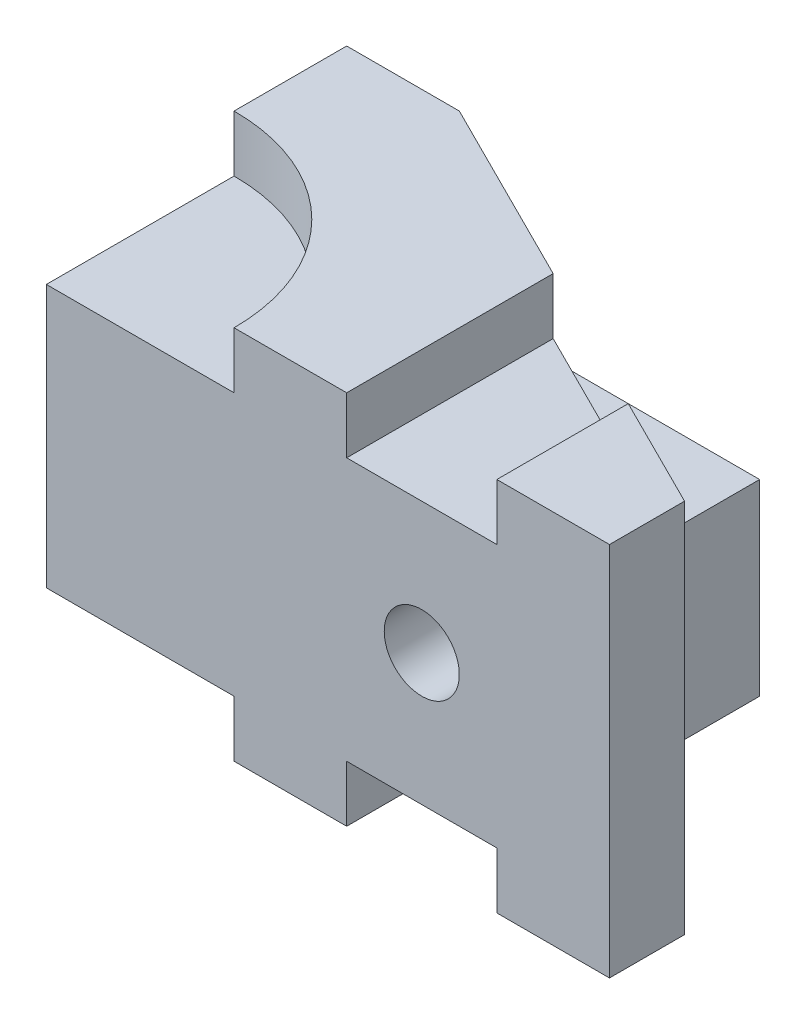
ISO-10303-21;
HEADER;
FILE_DESCRIPTION(('STEP AP214'),'2;1');
FILE_NAME('part.step','',(''),(''),'','','');
FILE_SCHEMA(('AUTOMOTIVE_DESIGN { 1 0 10303 214 1 1 1 1 }'));
ENDSEC;
DATA;
#1=APPLICATION_CONTEXT('core data for automotive mechanical design processes');
#2=APPLICATION_PROTOCOL_DEFINITION('international standard','automotive_design',2000,#1);
#3=PRODUCT_CONTEXT('',#1,'mechanical');
#4=PRODUCT('Part','Part','',(#3));
#5=PRODUCT_RELATED_PRODUCT_CATEGORY('part','',(#4));
#6=PRODUCT_DEFINITION_FORMATION('','',#4);
#7=PRODUCT_DEFINITION_CONTEXT('part definition',#1,'design');
#8=PRODUCT_DEFINITION('design','',#6,#7);
#9=PRODUCT_DEFINITION_SHAPE('','',#8);
#10=(LENGTH_UNIT() NAMED_UNIT(*) SI_UNIT(.MILLI.,.METRE.));
#11=(NAMED_UNIT(*) PLANE_ANGLE_UNIT() SI_UNIT($,.RADIAN.));
#12=(NAMED_UNIT(*) SI_UNIT($,.STERADIAN.) SOLID_ANGLE_UNIT());
#13=UNCERTAINTY_MEASURE_WITH_UNIT(LENGTH_MEASURE(1.E-05),#10,'distance_accuracy_value','');
#14=(GEOMETRIC_REPRESENTATION_CONTEXT(3) GLOBAL_UNCERTAINTY_ASSIGNED_CONTEXT((#13)) GLOBAL_UNIT_ASSIGNED_CONTEXT((#10,
#11,#12)) REPRESENTATION_CONTEXT('',''));
#15=CARTESIAN_POINT('',(0.,0.,0.));
#16=DIRECTION('',(0.,0.,1.));
#17=DIRECTION('',(1.,0.,0.));
#18=AXIS2_PLACEMENT_3D('',#15,#16,#17);
#19=CARTESIAN_POINT('',(-75.,100.,0.));
#20=DIRECTION('',(-1.,0.,0.));
#21=DIRECTION('',(0.,0.,1.));
#22=AXIS2_PLACEMENT_3D('',#19,#20,#21);
#23=PLANE('',#22);
#24=DIRECTION('',(0.,1.,0.));
#25=VECTOR('',#24,1.);
#26=CARTESIAN_POINT('',(-75.,65.,-20.));
#27=LINE('',#26,#25);
#28=CARTESIAN_POINT('',(-75.,35.,-20.));
#29=VERTEX_POINT('',#28);
#30=CARTESIAN_POINT('',(-75.,65.,-20.));
#31=VERTEX_POINT('',#30);
#32=EDGE_CURVE('E221',#29,#31,#27,.T.);
#33=ORIENTED_EDGE('',*,*,#32,.F.);
#34=DIRECTION('',(0.,0.,1.));
#35=VECTOR('',#34,1.);
#36=CARTESIAN_POINT('',(-75.,35.,-40.));
#37=LINE('',#36,#35);
#38=CARTESIAN_POINT('',(-75.,35.,-40.));
#39=VERTEX_POINT('',#38);
#40=EDGE_CURVE('E210',#39,#29,#37,.T.);
#41=ORIENTED_EDGE('',*,*,#40,.F.);
#42=DIRECTION('',(0.,-1.,0.));
#43=VECTOR('',#42,1.);
#44=CARTESIAN_POINT('',(-75.,100.,-40.));
#45=LINE('',#44,#43);
#46=CARTESIAN_POINT('',(-75.,0.,-40.));
#47=VERTEX_POINT('',#46);
#48=EDGE_CURVE('E219',#39,#47,#45,.T.);
#49=ORIENTED_EDGE('',*,*,#48,.T.);
#50=DIRECTION('',(0.,0.,-1.));
#51=VECTOR('',#50,1.);
#52=CARTESIAN_POINT('',(-75.,0.,0.));
#53=LINE('',#52,#51);
#54=CARTESIAN_POINT('',(-75.,0.,-10.));
#55=VERTEX_POINT('',#54);
#56=EDGE_CURVE('E377',#55,#47,#53,.T.);
#57=ORIENTED_EDGE('',*,*,#56,.F.);
#58=DIRECTION('',(0.,-1.,0.));
#59=VECTOR('',#58,1.);
#60=CARTESIAN_POINT('',(-75.,15.,-10.));
#61=LINE('',#60,#59);
#62=CARTESIAN_POINT('',(-75.,15.,-10.));
#63=VERTEX_POINT('',#62);
#64=EDGE_CURVE('E69',#55,#63,#61,.F.);
#65=ORIENTED_EDGE('',*,*,#64,.T.);
#66=DIRECTION('',(0.,0.,1.));
#67=VECTOR('',#66,1.);
#68=CARTESIAN_POINT('',(-75.,15.,0.));
#69=LINE('',#68,#67);
#70=CARTESIAN_POINT('',(-75.,15.,40.));
#71=VERTEX_POINT('',#70);
#72=EDGE_CURVE('E267',#63,#71,#69,.T.);
#73=ORIENTED_EDGE('',*,*,#72,.T.);
#74=DIRECTION('',(0.,-1.,0.));
#75=VECTOR('',#74,1.);
#76=CARTESIAN_POINT('',(-75.,100.,40.));
#77=LINE('',#76,#75);
#78=CARTESIAN_POINT('',(-75.,85.,40.));
#79=VERTEX_POINT('',#78);
#80=EDGE_CURVE('E231',#79,#71,#77,.T.);
#81=ORIENTED_EDGE('',*,*,#80,.F.);
#82=DIRECTION('',(0.,0.,-1.));
#83=VECTOR('',#82,1.);
#84=CARTESIAN_POINT('',(-75.,85.,0.));
#85=LINE('',#84,#83);
#86=CARTESIAN_POINT('',(-75.,85.,-10.));
#87=VERTEX_POINT('',#86);
#88=EDGE_CURVE('E286',#79,#87,#85,.T.);
#89=ORIENTED_EDGE('',*,*,#88,.T.);
#90=DIRECTION('',(0.,1.,0.));
#91=VECTOR('',#90,1.);
#92=CARTESIAN_POINT('',(-75.,85.,-10.));
#93=LINE('',#92,#91);
#94=CARTESIAN_POINT('',(-75.,100.,-10.));
#95=VERTEX_POINT('',#94);
#96=EDGE_CURVE('E291',#95,#87,#93,.F.);
#97=ORIENTED_EDGE('',*,*,#96,.F.);
#98=DIRECTION('',(0.,0.,-1.));
#99=VECTOR('',#98,1.);
#100=CARTESIAN_POINT('',(-75.,100.,0.));
#101=LINE('',#100,#99);
#102=CARTESIAN_POINT('',(-75.,100.,-40.));
#103=VERTEX_POINT('',#102);
#104=EDGE_CURVE('E358',#95,#103,#101,.T.);
#105=ORIENTED_EDGE('',*,*,#104,.T.);
#106=CARTESIAN_POINT('',(-75.,65.,-40.));
#107=VERTEX_POINT('',#106);
#108=EDGE_CURVE('E230',#103,#107,#45,.T.);
#109=ORIENTED_EDGE('',*,*,#108,.T.);
#110=DIRECTION('',(0.,0.,1.));
#111=VECTOR('',#110,1.);
#112=CARTESIAN_POINT('',(-75.,65.,-40.));
#113=LINE('',#112,#111);
#114=EDGE_CURVE('E61',#107,#31,#113,.T.);
#115=ORIENTED_EDGE('',*,*,#114,.T.);
#116=EDGE_LOOP('',(#33,#41,#49,#57,#65,#73,#81,#89,#97,#105,#109,#115));
#117=FACE_BOUND('',#116,.T.);
#118=ADVANCED_FACE('F45',(#117),#23,.T.);
#119=CARTESIAN_POINT('',(7.,100.,-14.));
#120=DIRECTION('',(0.447213595499958,0.,-0.894427190999916));
#121=DIRECTION('',(-0.894427190999916,0.,-0.447213595499958));
#122=AXIS2_PLACEMENT_3D('',#119,#120,#121);
#123=PLANE('',#122);
#124=DIRECTION('',(0.,-1.,0.));
#125=VECTOR('',#124,1.);
#126=CARTESIAN_POINT('',(-45.,100.,-40.));
#127=LINE('',#126,#125);
#128=CARTESIAN_POINT('',(-45.,35.,-40.));
#129=VERTEX_POINT('',#128);
#130=CARTESIAN_POINT('',(-45.,0.,-40.));
#131=VERTEX_POINT('',#130);
#132=EDGE_CURVE('E236',#129,#131,#127,.T.);
#133=ORIENTED_EDGE('',*,*,#132,.F.);
#134=DIRECTION('',(0.894427190999916,0.,0.447213595499958));
#135=VECTOR('',#134,1.);
#136=CARTESIAN_POINT('',(7.,35.,-14.));
#137=LINE('',#136,#135);
#138=CARTESIAN_POINT('',(-4.99999999999998,35.,-20.));
#139=VERTEX_POINT('',#138);
#140=EDGE_CURVE('E213',#129,#139,#137,.T.);
#141=ORIENTED_EDGE('',*,*,#140,.T.);
#142=DIRECTION('',(0.,-1.,0.));
#143=VECTOR('',#142,1.);
#144=CARTESIAN_POINT('',(-4.99999999999998,100.,-20.));
#145=LINE('',#144,#143);
#146=CARTESIAN_POINT('',(-4.99999999999998,25.,-20.));
#147=VERTEX_POINT('',#146);
#148=EDGE_CURVE('E246',#139,#147,#145,.T.);
#149=ORIENTED_EDGE('',*,*,#148,.T.);
#150=DIRECTION('',(0.894427190999916,0.,0.447213595499958));
#151=VECTOR('',#150,1.);
#152=CARTESIAN_POINT('',(-4.99999999999998,25.,-20.));
#153=LINE('',#152,#151);
#154=CARTESIAN_POINT('',(55.,25.,10.));
#155=VERTEX_POINT('',#154);
#156=EDGE_CURVE('E456',#147,#155,#153,.T.);
#157=ORIENTED_EDGE('',*,*,#156,.T.);
#158=DIRECTION('',(0.,-1.,0.));
#159=VECTOR('',#158,1.);
#160=CARTESIAN_POINT('',(55.,100.,10.));
#161=LINE('',#160,#159);
#162=CARTESIAN_POINT('',(55.,75.,10.));
#163=VERTEX_POINT('',#162);
#164=EDGE_CURVE('E255',#163,#155,#161,.T.);
#165=ORIENTED_EDGE('',*,*,#164,.F.);
#166=DIRECTION('',(0.894427190999916,0.,0.447213595499958));
#167=VECTOR('',#166,1.);
#168=CARTESIAN_POINT('',(-4.99999999999998,75.,-20.));
#169=LINE('',#168,#167);
#170=CARTESIAN_POINT('',(-4.99999999999998,75.,-20.));
#171=VERTEX_POINT('',#170);
#172=EDGE_CURVE('E435',#171,#163,#169,.T.);
#173=ORIENTED_EDGE('',*,*,#172,.F.);
#174=CARTESIAN_POINT('',(-4.99999999999998,65.,-20.));
#175=VERTEX_POINT('',#174);
#176=EDGE_CURVE('E247',#171,#175,#145,.T.);
#177=ORIENTED_EDGE('',*,*,#176,.T.);
#178=DIRECTION('',(-0.894427190999916,0.,-0.447213595499958));
#179=VECTOR('',#178,1.);
#180=CARTESIAN_POINT('',(7.,65.,-14.));
#181=LINE('',#180,#179);
#182=CARTESIAN_POINT('',(-45.,65.,-40.));
#183=VERTEX_POINT('',#182);
#184=EDGE_CURVE('E223',#175,#183,#181,.T.);
#185=ORIENTED_EDGE('',*,*,#184,.T.);
#186=CARTESIAN_POINT('',(-45.,100.,-40.));
#187=VERTEX_POINT('',#186);
#188=EDGE_CURVE('E242',#187,#183,#127,.T.);
#189=ORIENTED_EDGE('',*,*,#188,.F.);
#190=DIRECTION('',(0.894427190999916,0.,0.447213595499958));
#191=VECTOR('',#190,1.);
#192=CARTESIAN_POINT('',(7.,100.,-14.));
#193=LINE('',#192,#191);
#194=CARTESIAN_POINT('',(5.,100.,-15.));
#195=VERTEX_POINT('',#194);
#196=EDGE_CURVE('E350',#187,#195,#193,.T.);
#197=ORIENTED_EDGE('',*,*,#196,.T.);
#198=DIRECTION('',(0.,1.,0.));
#199=VECTOR('',#198,1.);
#200=CARTESIAN_POINT('',(5.,85.,-15.));
#201=LINE('',#200,#199);
#202=CARTESIAN_POINT('',(5.,85.,-15.));
#203=VERTEX_POINT('',#202);
#204=EDGE_CURVE('E312',#203,#195,#201,.T.);
#205=ORIENTED_EDGE('',*,*,#204,.F.);
#206=DIRECTION('',(-0.894427190999916,0.,-0.447213595499958));
#207=VECTOR('',#206,1.);
#208=CARTESIAN_POINT('',(5.,85.,-15.));
#209=LINE('',#208,#207);
#210=CARTESIAN_POINT('',(45.,85.,4.99999999999999));
#211=VERTEX_POINT('',#210);
#212=EDGE_CURVE('E330',#211,#203,#209,.T.);
#213=ORIENTED_EDGE('',*,*,#212,.F.);
#214=DIRECTION('',(0.,1.,0.));
#215=VECTOR('',#214,1.);
#216=CARTESIAN_POINT('',(45.,85.,4.99999999999999));
#217=LINE('',#216,#215);
#218=CARTESIAN_POINT('',(45.,100.,4.99999999999999));
#219=VERTEX_POINT('',#218);
#220=EDGE_CURVE('E308',#211,#219,#217,.T.);
#221=ORIENTED_EDGE('',*,*,#220,.T.);
#222=DIRECTION('',(0.894427190999916,0.,0.447213595499958));
#223=VECTOR('',#222,1.);
#224=CARTESIAN_POINT('',(7.,100.,-14.));
#225=LINE('',#224,#223);
#226=CARTESIAN_POINT('',(75.,100.,20.));
#227=VERTEX_POINT('',#226);
#228=EDGE_CURVE('E346',#219,#227,#225,.T.);
#229=ORIENTED_EDGE('',*,*,#228,.T.);
#230=DIRECTION('',(0.,-1.,0.));
#231=VECTOR('',#230,1.);
#232=CARTESIAN_POINT('',(75.,100.,20.));
#233=LINE('',#232,#231);
#234=CARTESIAN_POINT('',(75.,0.,20.));
#235=VERTEX_POINT('',#234);
#236=EDGE_CURVE('E368',#227,#235,#233,.T.);
#237=ORIENTED_EDGE('',*,*,#236,.T.);
#238=DIRECTION('',(0.894427190999916,0.,0.447213595499958));
#239=VECTOR('',#238,1.);
#240=CARTESIAN_POINT('',(7.,0.,-14.));
#241=LINE('',#240,#239);
#242=CARTESIAN_POINT('',(45.,0.,4.99999999999999));
#243=VERTEX_POINT('',#242);
#244=EDGE_CURVE('E345',#243,#235,#241,.T.);
#245=ORIENTED_EDGE('',*,*,#244,.F.);
#246=DIRECTION('',(0.,-1.,0.));
#247=VECTOR('',#246,1.);
#248=CARTESIAN_POINT('',(45.,15.,4.99999999999999));
#249=LINE('',#248,#247);
#250=CARTESIAN_POINT('',(45.,15.,4.99999999999999));
#251=VERTEX_POINT('',#250);
#252=EDGE_CURVE('E405',#251,#243,#249,.T.);
#253=ORIENTED_EDGE('',*,*,#252,.F.);
#254=DIRECTION('',(-0.894427190999916,0.,-0.447213595499958));
#255=VECTOR('',#254,1.);
#256=CARTESIAN_POINT('',(5.,15.,-15.));
#257=LINE('',#256,#255);
#258=CARTESIAN_POINT('',(5.,15.,-15.));
#259=VERTEX_POINT('',#258);
#260=EDGE_CURVE('E477',#251,#259,#257,.T.);
#261=ORIENTED_EDGE('',*,*,#260,.T.);
#262=DIRECTION('',(0.,-1.,0.));
#263=VECTOR('',#262,1.);
#264=CARTESIAN_POINT('',(5.,15.,-15.));
#265=LINE('',#264,#263);
#266=CARTESIAN_POINT('',(5.,0.,-15.));
#267=VERTEX_POINT('',#266);
#268=EDGE_CURVE('E415',#259,#267,#265,.T.);
#269=ORIENTED_EDGE('',*,*,#268,.T.);
#270=DIRECTION('',(0.894427190999916,0.,0.447213595499958));
#271=VECTOR('',#270,1.);
#272=CARTESIAN_POINT('',(7.,0.,-14.));
#273=LINE('',#272,#271);
#274=EDGE_CURVE('E372',#131,#267,#273,.T.);
#275=ORIENTED_EDGE('',*,*,#274,.F.);
#276=EDGE_LOOP('',(#133,#141,#149,#157,#165,#173,#177,#185,#189,#197,#205,#213,#221,#229,#237,
#245,#253,#261,#269,#275));
#277=FACE_BOUND('',#276,.T.);
#278=ADVANCED_FACE('F404',(#277),#123,.T.);
#279=CARTESIAN_POINT('',(0.,100.,-40.));
#280=DIRECTION('',(0.,0.,-1.));
#281=DIRECTION('',(-1.,0.,0.));
#282=AXIS2_PLACEMENT_3D('',#279,#280,#281);
#283=PLANE('',#282);
#284=ORIENTED_EDGE('',*,*,#48,.F.);
#285=DIRECTION('',(1.,0.,0.));
#286=VECTOR('',#285,1.);
#287=CARTESIAN_POINT('',(0.,35.,-40.));
#288=LINE('',#287,#286);
#289=EDGE_CURVE('E11',#39,#129,#288,.T.);
#290=ORIENTED_EDGE('',*,*,#289,.T.);
#291=ORIENTED_EDGE('',*,*,#132,.T.);
#292=DIRECTION('',(1.,0.,0.));
#293=VECTOR('',#292,1.);
#294=CARTESIAN_POINT('',(0.,0.,-40.));
#295=LINE('',#294,#293);
#296=EDGE_CURVE('E228',#47,#131,#295,.T.);
#297=ORIENTED_EDGE('',*,*,#296,.F.);
#298=EDGE_LOOP('',(#284,#290,#291,#297));
#299=FACE_BOUND('',#298,.T.);
#300=ADVANCED_FACE('F226',(#299),#283,.T.);
#301=ORIENTED_EDGE('',*,*,#188,.T.);
#302=DIRECTION('',(1.,0.,0.));
#303=VECTOR('',#302,1.);
#304=CARTESIAN_POINT('',(-4.99999999999998,65.,-40.));
#305=LINE('',#304,#303);
#306=EDGE_CURVE('E553',#107,#183,#305,.T.);
#307=ORIENTED_EDGE('',*,*,#306,.F.);
#308=ORIENTED_EDGE('',*,*,#108,.F.);
#309=DIRECTION('',(1.,0.,0.));
#310=VECTOR('',#309,1.);
#311=CARTESIAN_POINT('',(0.,100.,-40.));
#312=LINE('',#311,#310);
#313=EDGE_CURVE('E354',#103,#187,#312,.T.);
#314=ORIENTED_EDGE('',*,*,#313,.T.);
#315=EDGE_LOOP('',(#301,#307,#308,#314));
#316=FACE_BOUND('',#315,.T.);
#317=ADVANCED_FACE('F535',(#316),#283,.T.);
#318=CARTESIAN_POINT('',(0.,0.,0.));
#319=DIRECTION('',(0.,1.,0.));
#320=DIRECTION('',(0.,0.,1.));
#321=AXIS2_PLACEMENT_3D('',#318,#319,#320);
#322=PLANE('',#321);
#323=DIRECTION('',(0.,0.,-1.));
#324=VECTOR('',#323,1.);
#325=CARTESIAN_POINT('',(45.,0.,4.99999999999999));
#326=LINE('',#325,#324);
#327=CARTESIAN_POINT('',(45.,0.,40.));
#328=VERTEX_POINT('',#327);
#329=EDGE_CURVE('E401',#328,#243,#326,.T.);
#330=ORIENTED_EDGE('',*,*,#329,.T.);
#331=ORIENTED_EDGE('',*,*,#244,.T.);
#332=DIRECTION('',(0.,0.,-1.));
#333=VECTOR('',#332,1.);
#334=CARTESIAN_POINT('',(75.,0.,0.));
#335=LINE('',#334,#333);
#336=CARTESIAN_POINT('',(75.,0.,40.));
#337=VERTEX_POINT('',#336);
#338=EDGE_CURVE('E351',#337,#235,#335,.T.);
#339=ORIENTED_EDGE('',*,*,#338,.F.);
#340=DIRECTION('',(1.,0.,0.));
#341=VECTOR('',#340,1.);
#342=CARTESIAN_POINT('',(0.,0.,40.));
#343=LINE('',#342,#341);
#344=EDGE_CURVE('E380',#328,#337,#343,.T.);
#345=ORIENTED_EDGE('',*,*,#344,.F.);
#346=EDGE_LOOP('',(#330,#331,#339,#345));
#347=FACE_BOUND('',#346,.T.);
#348=ADVANCED_FACE('F400',(#347),#322,.F.);
#349=ORIENTED_EDGE('',*,*,#274,.T.);
#350=DIRECTION('',(0.,0.,1.));
#351=VECTOR('',#350,1.);
#352=CARTESIAN_POINT('',(5.,0.,40.));
#353=LINE('',#352,#351);
#354=CARTESIAN_POINT('',(5.,0.,40.));
#355=VERTEX_POINT('',#354);
#356=EDGE_CURVE('E461',#267,#355,#353,.T.);
#357=ORIENTED_EDGE('',*,*,#356,.T.);
#358=CARTESIAN_POINT('',(-25.,0.,40.));
#359=VERTEX_POINT('',#358);
#360=EDGE_CURVE('E383',#359,#355,#343,.T.);
#361=ORIENTED_EDGE('',*,*,#360,.F.);
#362=CARTESIAN_POINT('',(-75.,0.,40.));
#363=DIRECTION('',(0.,1.,0.));
#364=DIRECTION('',(0.,0.,1.));
#365=AXIS2_PLACEMENT_3D('',#362,#363,#364);
#366=CIRCLE('',#365,50.);
#367=EDGE_CURVE('E419',#359,#55,#366,.T.);
#368=ORIENTED_EDGE('',*,*,#367,.T.);
#369=ORIENTED_EDGE('',*,*,#56,.T.);
#370=ORIENTED_EDGE('',*,*,#296,.T.);
#371=EDGE_LOOP('',(#349,#357,#361,#368,#369,#370));
#372=FACE_BOUND('',#371,.T.);
#373=ADVANCED_FACE('F489',(#372),#322,.F.);
#374=CARTESIAN_POINT('',(0.,100.,40.));
#375=DIRECTION('',(0.,0.,-1.));
#376=DIRECTION('',(-1.,0.,0.));
#377=AXIS2_PLACEMENT_3D('',#374,#375,#376);
#378=PLANE('',#377);
#379=CARTESIAN_POINT('',(25.,50.,40.));
#380=DIRECTION('',(0.,0.,-1.));
#381=DIRECTION('',(-1.,0.,0.));
#382=AXIS2_PLACEMENT_3D('',#379,#380,#381);
#383=CIRCLE('',#382,10.);
#384=CARTESIAN_POINT('',(15.,50.,40.));
#385=VERTEX_POINT('',#384);
#386=EDGE_CURVE('E546',#385,#385,#383,.T.);
#387=ORIENTED_EDGE('',*,*,#386,.T.);
#388=EDGE_LOOP('',(#387));
#389=FACE_BOUND('',#388,.T.);
#390=DIRECTION('',(0.,-1.,0.));
#391=VECTOR('',#390,1.);
#392=CARTESIAN_POINT('',(-25.,15.,40.));
#393=LINE('',#392,#391);
#394=CARTESIAN_POINT('',(-25.,15.,40.));
#395=VERTEX_POINT('',#394);
#396=EDGE_CURVE('E428',#359,#395,#393,.F.);
#397=ORIENTED_EDGE('',*,*,#396,.F.);
#398=ORIENTED_EDGE('',*,*,#360,.T.);
#399=DIRECTION('',(0.,-1.,0.));
#400=VECTOR('',#399,1.);
#401=CARTESIAN_POINT('',(5.,15.,40.));
#402=LINE('',#401,#400);
#403=CARTESIAN_POINT('',(5.,15.,40.));
#404=VERTEX_POINT('',#403);
#405=EDGE_CURVE('E422',#404,#355,#402,.T.);
#406=ORIENTED_EDGE('',*,*,#405,.F.);
#407=DIRECTION('',(1.,0.,0.));
#408=VECTOR('',#407,1.);
#409=CARTESIAN_POINT('',(45.,15.,40.));
#410=LINE('',#409,#408);
#411=CARTESIAN_POINT('',(45.,15.,40.));
#412=VERTEX_POINT('',#411);
#413=EDGE_CURVE('E470',#404,#412,#410,.T.);
#414=ORIENTED_EDGE('',*,*,#413,.T.);
#415=DIRECTION('',(0.,-1.,0.));
#416=VECTOR('',#415,1.);
#417=CARTESIAN_POINT('',(45.,15.,40.));
#418=LINE('',#417,#416);
#419=EDGE_CURVE('E414',#412,#328,#418,.T.);
#420=ORIENTED_EDGE('',*,*,#419,.T.);
#421=ORIENTED_EDGE('',*,*,#344,.T.);
#422=DIRECTION('',(0.,-1.,0.));
#423=VECTOR('',#422,1.);
#424=CARTESIAN_POINT('',(75.,100.,40.));
#425=LINE('',#424,#423);
#426=CARTESIAN_POINT('',(75.,100.,40.));
#427=VERTEX_POINT('',#426);
#428=EDGE_CURVE('E238',#427,#337,#425,.T.);
#429=ORIENTED_EDGE('',*,*,#428,.F.);
#430=DIRECTION('',(1.,0.,0.));
#431=VECTOR('',#430,1.);
#432=CARTESIAN_POINT('',(0.,100.,40.));
#433=LINE('',#432,#431);
#434=CARTESIAN_POINT('',(45.,100.,40.));
#435=VERTEX_POINT('',#434);
#436=EDGE_CURVE('E361',#435,#427,#433,.T.);
#437=ORIENTED_EDGE('',*,*,#436,.F.);
#438=DIRECTION('',(0.,1.,0.));
#439=VECTOR('',#438,1.);
#440=CARTESIAN_POINT('',(45.,85.,40.));
#441=LINE('',#440,#439);
#442=CARTESIAN_POINT('',(45.,85.,40.));
#443=VERTEX_POINT('',#442);
#444=EDGE_CURVE('E304',#443,#435,#441,.T.);
#445=ORIENTED_EDGE('',*,*,#444,.F.);
#446=DIRECTION('',(1.,0.,0.));
#447=VECTOR('',#446,1.);
#448=CARTESIAN_POINT('',(45.,85.,40.));
#449=LINE('',#448,#447);
#450=CARTESIAN_POINT('',(5.,85.,40.));
#451=VERTEX_POINT('',#450);
#452=EDGE_CURVE('E323',#451,#443,#449,.T.);
#453=ORIENTED_EDGE('',*,*,#452,.F.);
#454=DIRECTION('',(0.,1.,0.));
#455=VECTOR('',#454,1.);
#456=CARTESIAN_POINT('',(5.,85.,40.));
#457=LINE('',#456,#455);
#458=CARTESIAN_POINT('',(5.,100.,40.));
#459=VERTEX_POINT('',#458);
#460=EDGE_CURVE('E316',#451,#459,#457,.T.);
#461=ORIENTED_EDGE('',*,*,#460,.T.);
#462=CARTESIAN_POINT('',(-25.,100.,40.));
#463=VERTEX_POINT('',#462);
#464=EDGE_CURVE('E364',#463,#459,#433,.T.);
#465=ORIENTED_EDGE('',*,*,#464,.F.);
#466=DIRECTION('',(0.,1.,0.));
#467=VECTOR('',#466,1.);
#468=CARTESIAN_POINT('',(-25.,85.,40.));
#469=LINE('',#468,#467);
#470=CARTESIAN_POINT('',(-25.,85.,40.));
#471=VERTEX_POINT('',#470);
#472=EDGE_CURVE('E280',#463,#471,#469,.F.);
#473=ORIENTED_EDGE('',*,*,#472,.T.);
#474=DIRECTION('',(1.,0.,0.));
#475=VECTOR('',#474,1.);
#476=CARTESIAN_POINT('',(0.,85.,40.));
#477=LINE('',#476,#475);
#478=EDGE_CURVE('E259',#79,#471,#477,.T.);
#479=ORIENTED_EDGE('',*,*,#478,.F.);
#480=ORIENTED_EDGE('',*,*,#80,.T.);
#481=DIRECTION('',(-1.,0.,0.));
#482=VECTOR('',#481,1.);
#483=CARTESIAN_POINT('',(0.,15.,40.));
#484=LINE('',#483,#482);
#485=EDGE_CURVE('E54',#395,#71,#484,.T.);
#486=ORIENTED_EDGE('',*,*,#485,.F.);
#487=EDGE_LOOP('',(#397,#398,#406,#414,#420,#421,#429,#437,#445,#453,#461,#465,#473,#479,#480,#486));
#488=FACE_BOUND('',#487,.T.);
#489=ADVANCED_FACE('F277',(#389,#488),#378,.F.);
#490=CARTESIAN_POINT('',(0.,100.,0.));
#491=DIRECTION('',(0.,1.,0.));
#492=DIRECTION('',(0.,0.,1.));
#493=AXIS2_PLACEMENT_3D('',#490,#491,#492);
#494=PLANE('',#493);
#495=DIRECTION('',(0.,0.,1.));
#496=VECTOR('',#495,1.);
#497=CARTESIAN_POINT('',(5.,100.,40.));
#498=LINE('',#497,#496);
#499=EDGE_CURVE('E320',#195,#459,#498,.T.);
#500=ORIENTED_EDGE('',*,*,#499,.F.);
#501=ORIENTED_EDGE('',*,*,#196,.F.);
#502=ORIENTED_EDGE('',*,*,#313,.F.);
#503=ORIENTED_EDGE('',*,*,#104,.F.);
#504=CARTESIAN_POINT('',(-75.,100.,40.));
#505=DIRECTION('',(0.,1.,0.));
#506=DIRECTION('',(0.,0.,1.));
#507=AXIS2_PLACEMENT_3D('',#504,#505,#506);
#508=CIRCLE('',#507,50.);
#509=EDGE_CURVE('E293',#463,#95,#508,.T.);
#510=ORIENTED_EDGE('',*,*,#509,.F.);
#511=ORIENTED_EDGE('',*,*,#464,.T.);
#512=EDGE_LOOP('',(#500,#501,#502,#503,#510,#511));
#513=FACE_BOUND('',#512,.T.);
#514=ADVANCED_FACE('F499',(#513),#494,.T.);
#515=CARTESIAN_POINT('',(55.,100.,0.));
#516=DIRECTION('',(1.,0.,0.));
#517=DIRECTION('',(0.,0.,-1.));
#518=AXIS2_PLACEMENT_3D('',#515,#516,#517);
#519=PLANE('',#518);
#520=DIRECTION('',(0.,0.,-1.));
#521=VECTOR('',#520,1.);
#522=CARTESIAN_POINT('',(55.,25.,10.));
#523=LINE('',#522,#521);
#524=CARTESIAN_POINT('',(55.,25.,-20.));
#525=VERTEX_POINT('',#524);
#526=EDGE_CURVE('E452',#155,#525,#523,.T.);
#527=ORIENTED_EDGE('',*,*,#526,.T.);
#528=DIRECTION('',(0.,-1.,0.));
#529=VECTOR('',#528,1.);
#530=CARTESIAN_POINT('',(55.,100.,-20.));
#531=LINE('',#530,#529);
#532=CARTESIAN_POINT('',(55.,75.,-20.));
#533=VERTEX_POINT('',#532);
#534=EDGE_CURVE('E251',#533,#525,#531,.T.);
#535=ORIENTED_EDGE('',*,*,#534,.F.);
#536=DIRECTION('',(0.,0.,-1.));
#537=VECTOR('',#536,1.);
#538=CARTESIAN_POINT('',(55.,75.,10.));
#539=LINE('',#538,#537);
#540=EDGE_CURVE('E301',#163,#533,#539,.T.);
#541=ORIENTED_EDGE('',*,*,#540,.F.);
#542=ORIENTED_EDGE('',*,*,#164,.T.);
#543=EDGE_LOOP('',(#527,#535,#541,#542));
#544=FACE_BOUND('',#543,.T.);
#545=ADVANCED_FACE('F47',(#544),#519,.T.);
#546=CARTESIAN_POINT('',(0.,100.,-20.));
#547=DIRECTION('',(0.,0.,-1.));
#548=DIRECTION('',(-1.,0.,0.));
#549=AXIS2_PLACEMENT_3D('',#546,#547,#548);
#550=PLANE('',#549);
#551=CARTESIAN_POINT('',(25.,50.,-20.));
#552=DIRECTION('',(0.,0.,-1.));
#553=DIRECTION('',(-1.,0.,0.));
#554=AXIS2_PLACEMENT_3D('',#551,#552,#553);
#555=CIRCLE('',#554,10.);
#556=CARTESIAN_POINT('',(15.,50.,-20.));
#557=VERTEX_POINT('',#556);
#558=EDGE_CURVE('E543',#557,#557,#555,.T.);
#559=ORIENTED_EDGE('',*,*,#558,.F.);
#560=EDGE_LOOP('',(#559));
#561=FACE_BOUND('',#560,.T.);
#562=DIRECTION('',(-1.,0.,0.));
#563=VECTOR('',#562,1.);
#564=CARTESIAN_POINT('',(55.,25.,-20.));
#565=LINE('',#564,#563);
#566=EDGE_CURVE('E457',#525,#147,#565,.T.);
#567=ORIENTED_EDGE('',*,*,#566,.T.);
#568=ORIENTED_EDGE('',*,*,#148,.F.);
#569=DIRECTION('',(-1.,0.,0.));
#570=VECTOR('',#569,1.);
#571=CARTESIAN_POINT('',(-4.99999999999998,35.,-20.));
#572=LINE('',#571,#570);
#573=EDGE_CURVE('E550',#139,#29,#572,.T.);
#574=ORIENTED_EDGE('',*,*,#573,.T.);
#575=ORIENTED_EDGE('',*,*,#32,.T.);
#576=DIRECTION('',(1.,0.,0.));
#577=VECTOR('',#576,1.);
#578=CARTESIAN_POINT('',(-4.99999999999998,65.,-20.));
#579=LINE('',#578,#577);
#580=EDGE_CURVE('E556',#31,#175,#579,.T.);
#581=ORIENTED_EDGE('',*,*,#580,.T.);
#582=ORIENTED_EDGE('',*,*,#176,.F.);
#583=DIRECTION('',(-1.,0.,0.));
#584=VECTOR('',#583,1.);
#585=CARTESIAN_POINT('',(55.,75.,-20.));
#586=LINE('',#585,#584);
#587=EDGE_CURVE('E274',#533,#171,#586,.T.);
#588=ORIENTED_EDGE('',*,*,#587,.F.);
#589=ORIENTED_EDGE('',*,*,#534,.T.);
#590=EDGE_LOOP('',(#567,#568,#574,#575,#581,#582,#588,#589));
#591=FACE_BOUND('',#590,.T.);
#592=ADVANCED_FACE('F448',(#561,#591),#550,.T.);
#593=CARTESIAN_POINT('',(75.,100.,0.));
#594=DIRECTION('',(-1.,0.,0.));
#595=DIRECTION('',(0.,0.,1.));
#596=AXIS2_PLACEMENT_3D('',#593,#594,#595);
#597=PLANE('',#596);
#598=ORIENTED_EDGE('',*,*,#338,.T.);
#599=ORIENTED_EDGE('',*,*,#236,.F.);
#600=DIRECTION('',(0.,0.,-1.));
#601=VECTOR('',#600,1.);
#602=CARTESIAN_POINT('',(75.,100.,0.));
#603=LINE('',#602,#601);
#604=EDGE_CURVE('E365',#427,#227,#603,.T.);
#605=ORIENTED_EDGE('',*,*,#604,.F.);
#606=ORIENTED_EDGE('',*,*,#428,.T.);
#607=EDGE_LOOP('',(#598,#599,#605,#606));
#608=FACE_BOUND('',#607,.T.);
#609=ADVANCED_FACE('F394',(#608),#597,.F.);
#610=ORIENTED_EDGE('',*,*,#228,.F.);
#611=DIRECTION('',(0.,0.,-1.));
#612=VECTOR('',#611,1.);
#613=CARTESIAN_POINT('',(45.,100.,4.99999999999999));
#614=LINE('',#613,#612);
#615=EDGE_CURVE('E298',#435,#219,#614,.T.);
#616=ORIENTED_EDGE('',*,*,#615,.F.);
#617=ORIENTED_EDGE('',*,*,#436,.T.);
#618=ORIENTED_EDGE('',*,*,#604,.T.);
#619=EDGE_LOOP('',(#610,#616,#617,#618));
#620=FACE_BOUND('',#619,.T.);
#621=ADVANCED_FACE('F514',(#620),#494,.T.);
#622=CARTESIAN_POINT('',(5.,85.,40.));
#623=DIRECTION('',(-1.,0.,0.));
#624=DIRECTION('',(0.,0.,1.));
#625=AXIS2_PLACEMENT_3D('',#622,#623,#624);
#626=PLANE('',#625);
#627=ORIENTED_EDGE('',*,*,#499,.T.);
#628=ORIENTED_EDGE('',*,*,#460,.F.);
#629=DIRECTION('',(0.,0.,1.));
#630=VECTOR('',#629,1.);
#631=CARTESIAN_POINT('',(5.,85.,40.));
#632=LINE('',#631,#630);
#633=EDGE_CURVE('E307',#203,#451,#632,.T.);
#634=ORIENTED_EDGE('',*,*,#633,.F.);
#635=ORIENTED_EDGE('',*,*,#204,.T.);
#636=EDGE_LOOP('',(#627,#628,#634,#635));
#637=FACE_BOUND('',#636,.T.);
#638=ADVANCED_FACE('F506',(#637),#626,.F.);
#639=CARTESIAN_POINT('',(45.,85.,4.99999999999999));
#640=DIRECTION('',(1.,0.,0.));
#641=DIRECTION('',(0.,0.,-1.));
#642=AXIS2_PLACEMENT_3D('',#639,#640,#641);
#643=PLANE('',#642);
#644=ORIENTED_EDGE('',*,*,#615,.T.);
#645=ORIENTED_EDGE('',*,*,#220,.F.);
#646=DIRECTION('',(0.,0.,-1.));
#647=VECTOR('',#646,1.);
#648=CARTESIAN_POINT('',(45.,85.,4.99999999999999));
#649=LINE('',#648,#647);
#650=EDGE_CURVE('E334',#443,#211,#649,.T.);
#651=ORIENTED_EDGE('',*,*,#650,.F.);
#652=ORIENTED_EDGE('',*,*,#444,.T.);
#653=EDGE_LOOP('',(#644,#645,#651,#652));
#654=FACE_BOUND('',#653,.T.);
#655=ADVANCED_FACE('F511',(#654),#643,.F.);
#656=CARTESIAN_POINT('',(0.,85.,0.));
#657=DIRECTION('',(0.,-1.,0.));
#658=DIRECTION('',(0.,0.,-1.));
#659=AXIS2_PLACEMENT_3D('',#656,#657,#658);
#660=PLANE('',#659);
#661=ORIENTED_EDGE('',*,*,#452,.T.);
#662=ORIENTED_EDGE('',*,*,#650,.T.);
#663=ORIENTED_EDGE('',*,*,#212,.T.);
#664=ORIENTED_EDGE('',*,*,#633,.T.);
#665=EDGE_LOOP('',(#661,#662,#663,#664));
#666=FACE_BOUND('',#665,.T.);
#667=ADVANCED_FACE('F508',(#666),#660,.F.);
#668=CARTESIAN_POINT('',(-75.,85.,40.));
#669=DIRECTION('',(0.,1.,0.));
#670=DIRECTION('',(0.,0.,1.));
#671=AXIS2_PLACEMENT_3D('',#668,#669,#670);
#672=CYLINDRICAL_SURFACE('',#671,50.);
#673=ORIENTED_EDGE('',*,*,#96,.T.);
#674=CARTESIAN_POINT('',(-75.,85.,40.));
#675=DIRECTION('',(0.,1.,0.));
#676=DIRECTION('',(0.,0.,1.));
#677=AXIS2_PLACEMENT_3D('',#674,#675,#676);
#678=CIRCLE('',#677,50.);
#679=EDGE_CURVE('E285',#471,#87,#678,.T.);
#680=ORIENTED_EDGE('',*,*,#679,.F.);
#681=ORIENTED_EDGE('',*,*,#472,.F.);
#682=ORIENTED_EDGE('',*,*,#509,.T.);
#683=EDGE_LOOP('',(#673,#680,#681,#682));
#684=FACE_BOUND('',#683,.T.);
#685=ADVANCED_FACE('F288',(#684),#672,.F.);
#686=CARTESIAN_POINT('',(-75.,85.,40.));
#687=DIRECTION('',(0.,1.,0.));
#688=DIRECTION('',(0.,0.,1.));
#689=AXIS2_PLACEMENT_3D('',#686,#687,#688);
#690=PLANE('',#689);
#691=ORIENTED_EDGE('',*,*,#478,.T.);
#692=ORIENTED_EDGE('',*,*,#679,.T.);
#693=ORIENTED_EDGE('',*,*,#88,.F.);
#694=EDGE_LOOP('',(#691,#692,#693));
#695=FACE_BOUND('',#694,.T.);
#696=ADVANCED_FACE('F284',(#695),#690,.T.);
#697=CARTESIAN_POINT('',(0.,75.,0.));
#698=DIRECTION('',(0.,-1.,0.));
#699=DIRECTION('',(0.,0.,-1.));
#700=AXIS2_PLACEMENT_3D('',#697,#698,#699);
#701=PLANE('',#700);
#702=ORIENTED_EDGE('',*,*,#587,.T.);
#703=ORIENTED_EDGE('',*,*,#172,.T.);
#704=ORIENTED_EDGE('',*,*,#540,.T.);
#705=EDGE_LOOP('',(#702,#703,#704));
#706=FACE_BOUND('',#705,.T.);
#707=ADVANCED_FACE('F441',(#706),#701,.F.);
#708=CARTESIAN_POINT('',(45.,15.,4.99999999999999));
#709=DIRECTION('',(-1.,0.,0.));
#710=DIRECTION('',(0.,0.,1.));
#711=AXIS2_PLACEMENT_3D('',#708,#709,#710);
#712=PLANE('',#711);
#713=ORIENTED_EDGE('',*,*,#329,.F.);
#714=ORIENTED_EDGE('',*,*,#419,.F.);
#715=DIRECTION('',(0.,0.,-1.));
#716=VECTOR('',#715,1.);
#717=CARTESIAN_POINT('',(45.,15.,4.99999999999999));
#718=LINE('',#717,#716);
#719=EDGE_CURVE('E411',#412,#251,#718,.T.);
#720=ORIENTED_EDGE('',*,*,#719,.T.);
#721=ORIENTED_EDGE('',*,*,#252,.T.);
#722=EDGE_LOOP('',(#713,#714,#720,#721));
#723=FACE_BOUND('',#722,.T.);
#724=ADVANCED_FACE('F408',(#723),#712,.T.);
#725=CARTESIAN_POINT('',(5.,15.,40.));
#726=DIRECTION('',(1.,0.,0.));
#727=DIRECTION('',(0.,0.,-1.));
#728=AXIS2_PLACEMENT_3D('',#725,#726,#727);
#729=PLANE('',#728);
#730=ORIENTED_EDGE('',*,*,#356,.F.);
#731=ORIENTED_EDGE('',*,*,#268,.F.);
#732=DIRECTION('',(0.,0.,1.));
#733=VECTOR('',#732,1.);
#734=CARTESIAN_POINT('',(5.,15.,40.));
#735=LINE('',#734,#733);
#736=EDGE_CURVE('E474',#259,#404,#735,.T.);
#737=ORIENTED_EDGE('',*,*,#736,.T.);
#738=ORIENTED_EDGE('',*,*,#405,.T.);
#739=EDGE_LOOP('',(#730,#731,#737,#738));
#740=FACE_BOUND('',#739,.T.);
#741=ADVANCED_FACE('F581',(#740),#729,.T.);
#742=CARTESIAN_POINT('',(0.,15.,0.));
#743=DIRECTION('',(0.,1.,0.));
#744=DIRECTION('',(0.,0.,-1.));
#745=AXIS2_PLACEMENT_3D('',#742,#743,#744);
#746=PLANE('',#745);
#747=ORIENTED_EDGE('',*,*,#413,.F.);
#748=ORIENTED_EDGE('',*,*,#736,.F.);
#749=ORIENTED_EDGE('',*,*,#260,.F.);
#750=ORIENTED_EDGE('',*,*,#719,.F.);
#751=EDGE_LOOP('',(#747,#748,#749,#750));
#752=FACE_BOUND('',#751,.T.);
#753=ADVANCED_FACE('F573',(#752),#746,.F.);
#754=CARTESIAN_POINT('',(-75.,15.,40.));
#755=DIRECTION('',(0.,-1.,0.));
#756=DIRECTION('',(0.,0.,-1.));
#757=AXIS2_PLACEMENT_3D('',#754,#755,#756);
#758=CYLINDRICAL_SURFACE('',#757,50.);
#759=ORIENTED_EDGE('',*,*,#367,.F.);
#760=ORIENTED_EDGE('',*,*,#396,.T.);
#761=CARTESIAN_POINT('',(-75.,15.,40.));
#762=DIRECTION('',(0.,1.,0.));
#763=DIRECTION('',(0.,0.,1.));
#764=AXIS2_PLACEMENT_3D('',#761,#762,#763);
#765=CIRCLE('',#764,50.);
#766=EDGE_CURVE('E268',#395,#63,#765,.T.);
#767=ORIENTED_EDGE('',*,*,#766,.T.);
#768=ORIENTED_EDGE('',*,*,#64,.F.);
#769=EDGE_LOOP('',(#759,#760,#767,#768));
#770=FACE_BOUND('',#769,.T.);
#771=ADVANCED_FACE('F571',(#770),#758,.F.);
#772=CARTESIAN_POINT('',(-75.,15.,40.));
#773=DIRECTION('',(0.,-1.,0.));
#774=DIRECTION('',(0.,0.,1.));
#775=AXIS2_PLACEMENT_3D('',#772,#773,#774);
#776=PLANE('',#775);
#777=ORIENTED_EDGE('',*,*,#766,.F.);
#778=ORIENTED_EDGE('',*,*,#485,.T.);
#779=ORIENTED_EDGE('',*,*,#72,.F.);
#780=EDGE_LOOP('',(#777,#778,#779));
#781=FACE_BOUND('',#780,.T.);
#782=ADVANCED_FACE('F266',(#781),#776,.T.);
#783=CARTESIAN_POINT('',(0.,25.,0.));
#784=DIRECTION('',(0.,1.,0.));
#785=DIRECTION('',(0.,0.,-1.));
#786=AXIS2_PLACEMENT_3D('',#783,#784,#785);
#787=PLANE('',#786);
#788=ORIENTED_EDGE('',*,*,#566,.F.);
#789=ORIENTED_EDGE('',*,*,#526,.F.);
#790=ORIENTED_EDGE('',*,*,#156,.F.);
#791=EDGE_LOOP('',(#788,#789,#790));
#792=FACE_BOUND('',#791,.T.);
#793=ADVANCED_FACE('F579',(#792),#787,.F.);
#794=CARTESIAN_POINT('',(-4.99999999999998,35.,-40.));
#795=DIRECTION('',(0.,1.,0.));
#796=DIRECTION('',(0.,0.,1.));
#797=AXIS2_PLACEMENT_3D('',#794,#795,#796);
#798=PLANE('',#797);
#799=ORIENTED_EDGE('',*,*,#289,.F.);
#800=ORIENTED_EDGE('',*,*,#40,.T.);
#801=ORIENTED_EDGE('',*,*,#573,.F.);
#802=ORIENTED_EDGE('',*,*,#140,.F.);
#803=EDGE_LOOP('',(#799,#800,#801,#802));
#804=FACE_BOUND('',#803,.T.);
#805=ADVANCED_FACE('F209',(#804),#798,.T.);
#806=CARTESIAN_POINT('',(-4.99999999999998,65.,-40.));
#807=DIRECTION('',(0.,-1.,0.));
#808=DIRECTION('',(0.,0.,-1.));
#809=AXIS2_PLACEMENT_3D('',#806,#807,#808);
#810=PLANE('',#809);
#811=ORIENTED_EDGE('',*,*,#580,.F.);
#812=ORIENTED_EDGE('',*,*,#114,.F.);
#813=ORIENTED_EDGE('',*,*,#306,.T.);
#814=ORIENTED_EDGE('',*,*,#184,.F.);
#815=EDGE_LOOP('',(#811,#812,#813,#814));
#816=FACE_BOUND('',#815,.T.);
#817=ADVANCED_FACE('F689',(#816),#810,.T.);
#818=CARTESIAN_POINT('',(25.,50.,40.));
#819=DIRECTION('',(0.,0.,-1.));
#820=DIRECTION('',(-1.,0.,0.));
#821=AXIS2_PLACEMENT_3D('',#818,#819,#820);
#822=CYLINDRICAL_SURFACE('',#821,10.);
#823=ORIENTED_EDGE('',*,*,#386,.F.);
#824=EDGE_LOOP('',(#823));
#825=FACE_BOUND('',#824,.T.);
#826=ORIENTED_EDGE('',*,*,#558,.T.);
#827=EDGE_LOOP('',(#826));
#828=FACE_BOUND('',#827,.T.);
#829=ADVANCED_FACE('F699',(#825,#828),#822,.F.);
#830=CLOSED_SHELL('',(#118,#278,#300,#317,#348,#373,#489,#514,#545,#592,#609,#621,#638,#655,
#667,#685,#696,#707,#724,#741,#753,#771,#782,#793,#805,#817,#829));
#831=MANIFOLD_SOLID_BREP('B2',#830);
#832=ADVANCED_BREP_SHAPE_REPRESENTATION('',(#18,#831),#14);
#833=SHAPE_DEFINITION_REPRESENTATION(#9,#832);
ENDSEC;
END-ISO-10303-21;
